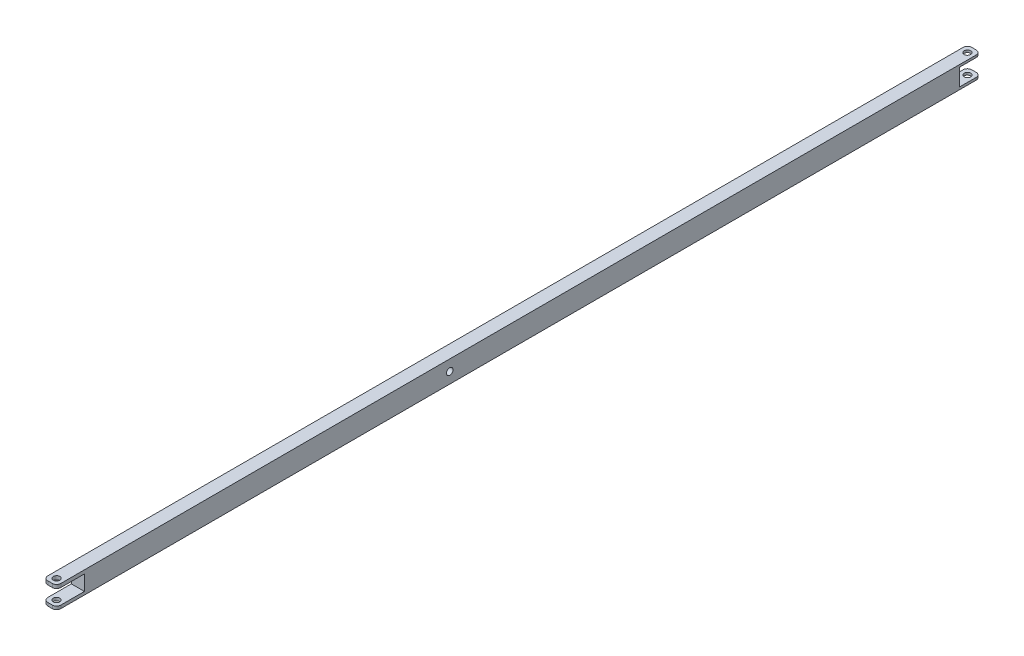
ISO-10303-21;
HEADER;
FILE_DESCRIPTION(('STEP AP214'),'2;1');
FILE_NAME('part.step','',(''),(''),'','','');
FILE_SCHEMA(('AUTOMOTIVE_DESIGN { 1 0 10303 214 1 1 1 1 }'));
ENDSEC;
DATA;
#1=APPLICATION_CONTEXT('core data for automotive mechanical design processes');
#2=APPLICATION_PROTOCOL_DEFINITION('international standard','automotive_design',2000,#1);
#3=PRODUCT_CONTEXT('',#1,'mechanical');
#4=PRODUCT('Part','Part','',(#3));
#5=PRODUCT_RELATED_PRODUCT_CATEGORY('part','',(#4));
#6=PRODUCT_DEFINITION_FORMATION('','',#4);
#7=PRODUCT_DEFINITION_CONTEXT('part definition',#1,'design');
#8=PRODUCT_DEFINITION('design','',#6,#7);
#9=PRODUCT_DEFINITION_SHAPE('','',#8);
#10=(LENGTH_UNIT() NAMED_UNIT(*) SI_UNIT(.MILLI.,.METRE.));
#11=(NAMED_UNIT(*) PLANE_ANGLE_UNIT() SI_UNIT($,.RADIAN.));
#12=(NAMED_UNIT(*) SI_UNIT($,.STERADIAN.) SOLID_ANGLE_UNIT());
#13=UNCERTAINTY_MEASURE_WITH_UNIT(LENGTH_MEASURE(1.E-05),#10,'distance_accuracy_value','');
#14=(GEOMETRIC_REPRESENTATION_CONTEXT(3) GLOBAL_UNCERTAINTY_ASSIGNED_CONTEXT((#13)) GLOBAL_UNIT_ASSIGNED_CONTEXT((#10,
#11,#12)) REPRESENTATION_CONTEXT('',''));
#15=CARTESIAN_POINT('',(0.,0.,0.));
#16=DIRECTION('',(0.,0.,1.));
#17=DIRECTION('',(1.,0.,0.));
#18=AXIS2_PLACEMENT_3D('',#15,#16,#17);
#19=CARTESIAN_POINT('',(0.,0.,-80.));
#20=DIRECTION('',(0.,0.,-1.));
#21=DIRECTION('',(-1.,0.,0.));
#22=AXIS2_PLACEMENT_3D('',#19,#20,#21);
#23=PLANE('',#22);
#24=DIRECTION('',(-1.,0.,0.));
#25=VECTOR('',#24,1.);
#26=CARTESIAN_POINT('',(0.,1.42668803014151,-80.));
#27=LINE('',#26,#25);
#28=CARTESIAN_POINT('',(5.12,1.42668803014152,-80.));
#29=VERTEX_POINT('',#28);
#30=CARTESIAN_POINT('',(2.5,1.42668803014151,-80.));
#31=VERTEX_POINT('',#30);
#32=EDGE_CURVE('E316',#29,#31,#27,.T.);
#33=ORIENTED_EDGE('',*,*,#32,.F.);
#34=DIRECTION('',(0.,-1.,0.));
#35=VECTOR('',#34,1.);
#36=CARTESIAN_POINT('',(5.12,0.,-80.));
#37=LINE('',#36,#35);
#38=CARTESIAN_POINT('',(5.12,0.,-80.));
#39=VERTEX_POINT('',#38);
#40=EDGE_CURVE('E348',#29,#39,#37,.T.);
#41=ORIENTED_EDGE('',*,*,#40,.T.);
#42=DIRECTION('',(-1.,0.,0.));
#43=VECTOR('',#42,1.);
#44=CARTESIAN_POINT('',(7.62,0.,-80.));
#45=LINE('',#44,#43);
#46=CARTESIAN_POINT('',(2.5,0.,-80.));
#47=VERTEX_POINT('',#46);
#48=EDGE_CURVE('E211',#39,#47,#45,.T.);
#49=ORIENTED_EDGE('',*,*,#48,.T.);
#50=DIRECTION('',(0.,1.,0.));
#51=VECTOR('',#50,1.);
#52=CARTESIAN_POINT('',(2.5,1.42668803014151,-80.));
#53=LINE('',#52,#51);
#54=EDGE_CURVE('E345',#47,#31,#53,.T.);
#55=ORIENTED_EDGE('',*,*,#54,.T.);
#56=EDGE_LOOP('',(#33,#41,#49,#55));
#57=FACE_BOUND('',#56,.T.);
#58=ADVANCED_FACE('F35',(#57),#23,.T.);
#59=CARTESIAN_POINT('',(0.,0.,457.2));
#60=DIRECTION('',(0.,0.,-1.));
#61=DIRECTION('',(-1.,0.,0.));
#62=AXIS2_PLACEMENT_3D('',#59,#60,#61);
#63=PLANE('',#62);
#64=DIRECTION('',(1.,0.,0.));
#65=VECTOR('',#64,1.);
#66=CARTESIAN_POINT('',(0.,10.6364679224859,457.2));
#67=LINE('',#66,#65);
#68=CARTESIAN_POINT('',(2.5,10.6364679224859,457.2));
#69=VERTEX_POINT('',#68);
#70=CARTESIAN_POINT('',(5.12,10.6364679224859,457.2));
#71=VERTEX_POINT('',#70);
#72=EDGE_CURVE('E273',#69,#71,#67,.T.);
#73=ORIENTED_EDGE('',*,*,#72,.T.);
#74=DIRECTION('',(0.,1.,0.));
#75=VECTOR('',#74,1.);
#76=CARTESIAN_POINT('',(5.12,0.,457.2));
#77=LINE('',#76,#75);
#78=CARTESIAN_POINT('',(5.11999999999999,12.7,457.2));
#79=VERTEX_POINT('',#78);
#80=EDGE_CURVE('E303',#71,#79,#77,.T.);
#81=ORIENTED_EDGE('',*,*,#80,.T.);
#82=DIRECTION('',(-1.,0.,0.));
#83=VECTOR('',#82,1.);
#84=CARTESIAN_POINT('',(0.,12.7,457.2));
#85=LINE('',#84,#83);
#86=CARTESIAN_POINT('',(2.5,12.7,457.2));
#87=VERTEX_POINT('',#86);
#88=EDGE_CURVE('E256',#79,#87,#85,.T.);
#89=ORIENTED_EDGE('',*,*,#88,.T.);
#90=DIRECTION('',(0.,-1.,0.));
#91=VECTOR('',#90,1.);
#92=CARTESIAN_POINT('',(2.5,0.,457.2));
#93=LINE('',#92,#91);
#94=EDGE_CURVE('E300',#87,#69,#93,.T.);
#95=ORIENTED_EDGE('',*,*,#94,.T.);
#96=EDGE_LOOP('',(#73,#81,#89,#95));
#97=FACE_BOUND('',#96,.T.);
#98=ADVANCED_FACE('F378',(#97),#63,.F.);
#99=CARTESIAN_POINT('',(0.,0.,457.2));
#100=DIRECTION('',(1.,0.,0.));
#101=DIRECTION('',(0.,1.,0.));
#102=AXIS2_PLACEMENT_3D('',#99,#100,#101);
#103=PLANE('',#102);
#104=CARTESIAN_POINT('',(0.,6.35,228.6));
#105=DIRECTION('',(1.,0.,0.));
#106=DIRECTION('',(0.,1.,0.));
#107=AXIS2_PLACEMENT_3D('',#104,#105,#106);
#108=CIRCLE('',#107,1.90499999999999);
#109=CARTESIAN_POINT('',(0.,8.25499999999999,228.6));
#110=VERTEX_POINT('',#109);
#111=EDGE_CURVE('E250',#110,#110,#108,.T.);
#112=ORIENTED_EDGE('',*,*,#111,.T.);
#113=EDGE_LOOP('',(#112));
#114=FACE_BOUND('',#113,.T.);
#115=DIRECTION('',(0.,0.,-1.));
#116=VECTOR('',#115,1.);
#117=CARTESIAN_POINT('',(0.,12.7,457.2));
#118=LINE('',#117,#116);
#119=CARTESIAN_POINT('',(0.,12.7,454.7));
#120=VERTEX_POINT('',#119);
#121=CARTESIAN_POINT('',(0.,12.7,-77.5));
#122=VERTEX_POINT('',#121);
#123=EDGE_CURVE('E259',#120,#122,#118,.T.);
#124=ORIENTED_EDGE('',*,*,#123,.T.);
#125=DIRECTION('',(0.,1.,0.));
#126=VECTOR('',#125,1.);
#127=CARTESIAN_POINT('',(0.,11.3648777422697,-77.5));
#128=LINE('',#127,#126);
#129=CARTESIAN_POINT('',(0.,11.3648777422697,-77.5));
#130=VERTEX_POINT('',#129);
#131=EDGE_CURVE('E336',#122,#130,#128,.F.);
#132=ORIENTED_EDGE('',*,*,#131,.T.);
#133=DIRECTION('',(0.,0.,1.));
#134=VECTOR('',#133,1.);
#135=CARTESIAN_POINT('',(0.,11.3648777422697,457.2));
#136=LINE('',#135,#134);
#137=CARTESIAN_POINT('',(0.,11.3648777422697,-67.8669017495956));
#138=VERTEX_POINT('',#137);
#139=EDGE_CURVE('E204',#130,#138,#136,.T.);
#140=ORIENTED_EDGE('',*,*,#139,.T.);
#141=DIRECTION('',(0.,-1.,0.));
#142=VECTOR('',#141,1.);
#143=CARTESIAN_POINT('',(0.,0.,-67.8669017495957));
#144=LINE('',#143,#142);
#145=CARTESIAN_POINT('',(0.,1.42668803014151,-67.8669017495956));
#146=VERTEX_POINT('',#145);
#147=EDGE_CURVE('E194',#138,#146,#144,.T.);
#148=ORIENTED_EDGE('',*,*,#147,.T.);
#149=DIRECTION('',(0.,0.,-1.));
#150=VECTOR('',#149,1.);
#151=CARTESIAN_POINT('',(0.,1.42668803014151,457.2));
#152=LINE('',#151,#150);
#153=CARTESIAN_POINT('',(0.,1.42668803014151,-77.5));
#154=VERTEX_POINT('',#153);
#155=EDGE_CURVE('E207',#146,#154,#152,.T.);
#156=ORIENTED_EDGE('',*,*,#155,.T.);
#157=DIRECTION('',(0.,1.,0.));
#158=VECTOR('',#157,1.);
#159=CARTESIAN_POINT('',(0.,0.,-77.5));
#160=LINE('',#159,#158);
#161=CARTESIAN_POINT('',(0.,0.,-77.5));
#162=VERTEX_POINT('',#161);
#163=EDGE_CURVE('E334',#154,#162,#160,.F.);
#164=ORIENTED_EDGE('',*,*,#163,.T.);
#165=DIRECTION('',(0.,0.,-1.));
#166=VECTOR('',#165,1.);
#167=CARTESIAN_POINT('',(0.,0.,457.2));
#168=LINE('',#167,#166);
#169=CARTESIAN_POINT('',(0.,0.,454.7));
#170=VERTEX_POINT('',#169);
#171=EDGE_CURVE('E268',#170,#162,#168,.T.);
#172=ORIENTED_EDGE('',*,*,#171,.F.);
#173=DIRECTION('',(0.,-1.,0.));
#174=VECTOR('',#173,1.);
#175=CARTESIAN_POINT('',(0.,0.,454.7));
#176=LINE('',#175,#174);
#177=CARTESIAN_POINT('',(0.,1.81598845239703,454.7));
#178=VERTEX_POINT('',#177);
#179=EDGE_CURVE('E290',#170,#178,#176,.F.);
#180=ORIENTED_EDGE('',*,*,#179,.T.);
#181=DIRECTION('',(0.,0.,-1.));
#182=VECTOR('',#181,1.);
#183=CARTESIAN_POINT('',(0.,1.81598845239703,457.2));
#184=LINE('',#183,#182);
#185=CARTESIAN_POINT('',(0.,1.81598845239703,441.01304137713));
#186=VERTEX_POINT('',#185);
#187=EDGE_CURVE('E237',#178,#186,#184,.T.);
#188=ORIENTED_EDGE('',*,*,#187,.T.);
#189=DIRECTION('',(0.,1.,0.));
#190=VECTOR('',#189,1.);
#191=CARTESIAN_POINT('',(0.,0.,441.01304137713));
#192=LINE('',#191,#190);
#193=CARTESIAN_POINT('',(0.,10.6364679224859,441.01304137713));
#194=VERTEX_POINT('',#193);
#195=EDGE_CURVE('E244',#186,#194,#192,.T.);
#196=ORIENTED_EDGE('',*,*,#195,.T.);
#197=DIRECTION('',(0.,0.,1.));
#198=VECTOR('',#197,1.);
#199=CARTESIAN_POINT('',(0.,10.6364679224859,457.2));
#200=LINE('',#199,#198);
#201=CARTESIAN_POINT('',(0.,10.6364679224859,454.7));
#202=VERTEX_POINT('',#201);
#203=EDGE_CURVE('E241',#194,#202,#200,.T.);
#204=ORIENTED_EDGE('',*,*,#203,.T.);
#205=DIRECTION('',(0.,-1.,0.));
#206=VECTOR('',#205,1.);
#207=CARTESIAN_POINT('',(0.,0.,454.7));
#208=LINE('',#207,#206);
#209=EDGE_CURVE('E288',#202,#120,#208,.F.);
#210=ORIENTED_EDGE('',*,*,#209,.T.);
#211=EDGE_LOOP('',(#124,#132,#140,#148,#156,#164,#172,#180,#188,#196,#204,#210));
#212=FACE_BOUND('',#211,.T.);
#213=ADVANCED_FACE('F358',(#114,#212),#103,.F.);
#214=CARTESIAN_POINT('',(0.,0.,457.2));
#215=DIRECTION('',(0.,1.,0.));
#216=DIRECTION('',(0.,0.,1.));
#217=AXIS2_PLACEMENT_3D('',#214,#215,#216);
#218=PLANE('',#217);
#219=CARTESIAN_POINT('',(3.89156117547884,0.,-76.1084388245213));
#220=DIRECTION('',(0.,1.,0.));
#221=DIRECTION('',(0.,0.,1.));
#222=AXIS2_PLACEMENT_3D('',#219,#220,#221);
#223=CIRCLE('',#222,1.90500000000001);
#224=CARTESIAN_POINT('',(3.89156117547884,0.,-74.2034388245212));
#225=VERTEX_POINT('',#224);
#226=EDGE_CURVE('E185',#225,#225,#223,.T.);
#227=ORIENTED_EDGE('',*,*,#226,.T.);
#228=EDGE_LOOP('',(#227));
#229=FACE_BOUND('',#228,.T.);
#230=CARTESIAN_POINT('',(3.81,0.,453.39));
#231=DIRECTION('',(0.,1.,0.));
#232=DIRECTION('',(0.,0.,1.));
#233=AXIS2_PLACEMENT_3D('',#230,#231,#232);
#234=CIRCLE('',#233,1.90585659935235);
#235=CARTESIAN_POINT('',(3.81,0.,455.295856599352));
#236=VERTEX_POINT('',#235);
#237=EDGE_CURVE('E223',#236,#236,#234,.T.);
#238=ORIENTED_EDGE('',*,*,#237,.T.);
#239=EDGE_LOOP('',(#238));
#240=FACE_BOUND('',#239,.T.);
#241=ORIENTED_EDGE('',*,*,#48,.F.);
#242=CARTESIAN_POINT('',(5.12,0.,-77.5));
#243=DIRECTION('',(0.,1.,0.));
#244=DIRECTION('',(0.,0.,1.));
#245=AXIS2_PLACEMENT_3D('',#242,#243,#244);
#246=CIRCLE('',#245,2.5);
#247=CARTESIAN_POINT('',(7.62,0.,-77.5));
#248=VERTEX_POINT('',#247);
#249=EDGE_CURVE('E58',#39,#248,#246,.F.);
#250=ORIENTED_EDGE('',*,*,#249,.T.);
#251=DIRECTION('',(0.,0.,-1.));
#252=VECTOR('',#251,1.);
#253=CARTESIAN_POINT('',(7.62,0.,457.2));
#254=LINE('',#253,#252);
#255=CARTESIAN_POINT('',(7.62,0.,454.7));
#256=VERTEX_POINT('',#255);
#257=EDGE_CURVE('E265',#256,#248,#254,.T.);
#258=ORIENTED_EDGE('',*,*,#257,.F.);
#259=CARTESIAN_POINT('',(5.12,0.,454.7));
#260=DIRECTION('',(0.,1.,0.));
#261=DIRECTION('',(0.,0.,1.));
#262=AXIS2_PLACEMENT_3D('',#259,#260,#261);
#263=CIRCLE('',#262,2.5);
#264=CARTESIAN_POINT('',(5.12,0.,457.2));
#265=VERTEX_POINT('',#264);
#266=EDGE_CURVE('E284',#256,#265,#263,.F.);
#267=ORIENTED_EDGE('',*,*,#266,.T.);
#268=DIRECTION('',(1.,0.,0.));
#269=VECTOR('',#268,1.);
#270=CARTESIAN_POINT('',(0.,0.,457.2));
#271=LINE('',#270,#269);
#272=CARTESIAN_POINT('',(2.5,0.,457.2));
#273=VERTEX_POINT('',#272);
#274=EDGE_CURVE('E253',#273,#265,#271,.T.);
#275=ORIENTED_EDGE('',*,*,#274,.F.);
#276=CARTESIAN_POINT('',(2.5,0.,454.7));
#277=DIRECTION('',(0.,1.,0.));
#278=DIRECTION('',(0.,0.,1.));
#279=AXIS2_PLACEMENT_3D('',#276,#277,#278);
#280=CIRCLE('',#279,2.5);
#281=EDGE_CURVE('E286',#273,#170,#280,.F.);
#282=ORIENTED_EDGE('',*,*,#281,.T.);
#283=ORIENTED_EDGE('',*,*,#171,.T.);
#284=CARTESIAN_POINT('',(2.5,0.,-77.5));
#285=DIRECTION('',(0.,1.,0.));
#286=DIRECTION('',(0.,0.,1.));
#287=AXIS2_PLACEMENT_3D('',#284,#285,#286);
#288=CIRCLE('',#287,2.5);
#289=EDGE_CURVE('E50',#162,#47,#288,.F.);
#290=ORIENTED_EDGE('',*,*,#289,.T.);
#291=EDGE_LOOP('',(#241,#250,#258,#267,#275,#282,#283,#290));
#292=FACE_BOUND('',#291,.T.);
#293=ADVANCED_FACE('F361',(#229,#240,#292),#218,.F.);
#294=CARTESIAN_POINT('',(7.62,0.,457.2));
#295=DIRECTION('',(-1.,0.,0.));
#296=DIRECTION('',(0.,-1.,0.));
#297=AXIS2_PLACEMENT_3D('',#294,#295,#296);
#298=PLANE('',#297);
#299=CARTESIAN_POINT('',(7.62,6.35,228.6));
#300=DIRECTION('',(1.,0.,0.));
#301=DIRECTION('',(0.,1.,0.));
#302=AXIS2_PLACEMENT_3D('',#299,#300,#301);
#303=CIRCLE('',#302,1.90499999999999);
#304=CARTESIAN_POINT('',(7.62,8.25499999999999,228.6));
#305=VERTEX_POINT('',#304);
#306=EDGE_CURVE('E247',#305,#305,#303,.T.);
#307=ORIENTED_EDGE('',*,*,#306,.F.);
#308=EDGE_LOOP('',(#307));
#309=FACE_BOUND('',#308,.T.);
#310=DIRECTION('',(0.,0.,1.));
#311=VECTOR('',#310,1.);
#312=CARTESIAN_POINT('',(7.62,11.3648777422697,-80.));
#313=LINE('',#312,#311);
#314=CARTESIAN_POINT('',(7.62,11.3648777422697,-77.5));
#315=VERTEX_POINT('',#314);
#316=CARTESIAN_POINT('',(7.62,11.3648777422697,-67.8669017495956));
#317=VERTEX_POINT('',#316);
#318=EDGE_CURVE('E174',#315,#317,#313,.T.);
#319=ORIENTED_EDGE('',*,*,#318,.F.);
#320=DIRECTION('',(0.,-1.,0.));
#321=VECTOR('',#320,1.);
#322=CARTESIAN_POINT('',(7.62,12.7,-77.5));
#323=LINE('',#322,#321);
#324=CARTESIAN_POINT('',(7.62,12.7,-77.5));
#325=VERTEX_POINT('',#324);
#326=EDGE_CURVE('E343',#315,#325,#323,.F.);
#327=ORIENTED_EDGE('',*,*,#326,.T.);
#328=DIRECTION('',(0.,0.,-1.));
#329=VECTOR('',#328,1.);
#330=CARTESIAN_POINT('',(7.62,12.7,457.2));
#331=LINE('',#330,#329);
#332=CARTESIAN_POINT('',(7.62,12.7,454.7));
#333=VERTEX_POINT('',#332);
#334=EDGE_CURVE('E262',#333,#325,#331,.T.);
#335=ORIENTED_EDGE('',*,*,#334,.F.);
#336=DIRECTION('',(0.,1.,0.));
#337=VECTOR('',#336,1.);
#338=CARTESIAN_POINT('',(7.62,0.,454.7));
#339=LINE('',#338,#337);
#340=CARTESIAN_POINT('',(7.62,10.6364679224859,454.7));
#341=VERTEX_POINT('',#340);
#342=EDGE_CURVE('E296',#333,#341,#339,.F.);
#343=ORIENTED_EDGE('',*,*,#342,.T.);
#344=DIRECTION('',(0.,0.,1.));
#345=VECTOR('',#344,1.);
#346=CARTESIAN_POINT('',(7.62,10.6364679224859,457.2));
#347=LINE('',#346,#345);
#348=CARTESIAN_POINT('',(7.62,10.6364679224859,441.01304137713));
#349=VERTEX_POINT('',#348);
#350=EDGE_CURVE('E231',#349,#341,#347,.T.);
#351=ORIENTED_EDGE('',*,*,#350,.F.);
#352=DIRECTION('',(0.,1.,0.));
#353=VECTOR('',#352,1.);
#354=CARTESIAN_POINT('',(7.62,10.6364679224859,441.01304137713));
#355=LINE('',#354,#353);
#356=CARTESIAN_POINT('',(7.62,1.81598845239703,441.01304137713));
#357=VERTEX_POINT('',#356);
#358=EDGE_CURVE('E228',#357,#349,#355,.T.);
#359=ORIENTED_EDGE('',*,*,#358,.F.);
#360=DIRECTION('',(0.,0.,-1.));
#361=VECTOR('',#360,1.);
#362=CARTESIAN_POINT('',(7.62,1.81598845239703,457.2));
#363=LINE('',#362,#361);
#364=CARTESIAN_POINT('',(7.62,1.81598845239703,454.7));
#365=VERTEX_POINT('',#364);
#366=EDGE_CURVE('E226',#365,#357,#363,.T.);
#367=ORIENTED_EDGE('',*,*,#366,.F.);
#368=DIRECTION('',(0.,1.,0.));
#369=VECTOR('',#368,1.);
#370=CARTESIAN_POINT('',(7.62,0.,454.7));
#371=LINE('',#370,#369);
#372=EDGE_CURVE('E298',#365,#256,#371,.F.);
#373=ORIENTED_EDGE('',*,*,#372,.T.);
#374=ORIENTED_EDGE('',*,*,#257,.T.);
#375=DIRECTION('',(0.,-1.,0.));
#376=VECTOR('',#375,1.);
#377=CARTESIAN_POINT('',(7.62,1.42668803014152,-77.5));
#378=LINE('',#377,#376);
#379=CARTESIAN_POINT('',(7.62,1.42668803014152,-77.5));
#380=VERTEX_POINT('',#379);
#381=EDGE_CURVE('E341',#248,#380,#378,.F.);
#382=ORIENTED_EDGE('',*,*,#381,.T.);
#383=DIRECTION('',(0.,0.,-1.));
#384=VECTOR('',#383,1.);
#385=CARTESIAN_POINT('',(7.62,1.42668803014152,-80.));
#386=LINE('',#385,#384);
#387=CARTESIAN_POINT('',(7.62,1.42668803014152,-67.8669017495956));
#388=VERTEX_POINT('',#387);
#389=EDGE_CURVE('E196',#388,#380,#386,.T.);
#390=ORIENTED_EDGE('',*,*,#389,.F.);
#391=DIRECTION('',(0.,-1.,0.));
#392=VECTOR('',#391,1.);
#393=CARTESIAN_POINT('',(7.62,11.3648777422697,-67.8669017495956));
#394=LINE('',#393,#392);
#395=EDGE_CURVE('E184',#317,#388,#394,.T.);
#396=ORIENTED_EDGE('',*,*,#395,.F.);
#397=EDGE_LOOP('',(#319,#327,#335,#343,#351,#359,#367,#373,#374,#382,#390,#396));
#398=FACE_BOUND('',#397,.T.);
#399=ADVANCED_FACE('F198',(#309,#398),#298,.F.);
#400=CARTESIAN_POINT('',(0.,12.7,457.2));
#401=DIRECTION('',(0.,-1.,0.));
#402=DIRECTION('',(0.,0.,-1.));
#403=AXIS2_PLACEMENT_3D('',#400,#401,#402);
#404=PLANE('',#403);
#405=CARTESIAN_POINT('',(3.89156117547884,12.7,-76.1084388245213));
#406=DIRECTION('',(0.,1.,0.));
#407=DIRECTION('',(0.,0.,1.));
#408=AXIS2_PLACEMENT_3D('',#405,#406,#407);
#409=CIRCLE('',#408,1.90500000000001);
#410=CARTESIAN_POINT('',(3.89156117547884,12.7,-74.2034388245212));
#411=VERTEX_POINT('',#410);
#412=EDGE_CURVE('E324',#411,#411,#409,.T.);
#413=ORIENTED_EDGE('',*,*,#412,.F.);
#414=EDGE_LOOP('',(#413));
#415=FACE_BOUND('',#414,.T.);
#416=CARTESIAN_POINT('',(3.81,12.7,453.39));
#417=DIRECTION('',(0.,1.,0.));
#418=DIRECTION('',(0.,0.,1.));
#419=AXIS2_PLACEMENT_3D('',#416,#417,#418);
#420=CIRCLE('',#419,1.90585659935235);
#421=CARTESIAN_POINT('',(3.81,12.7,455.295856599352));
#422=VERTEX_POINT('',#421);
#423=EDGE_CURVE('E216',#422,#422,#420,.T.);
#424=ORIENTED_EDGE('',*,*,#423,.F.);
#425=EDGE_LOOP('',(#424));
#426=FACE_BOUND('',#425,.T.);
#427=DIRECTION('',(1.,0.,0.));
#428=VECTOR('',#427,1.);
#429=CARTESIAN_POINT('',(0.,12.7,-80.));
#430=LINE('',#429,#428);
#431=CARTESIAN_POINT('',(2.5,12.7,-80.));
#432=VERTEX_POINT('',#431);
#433=CARTESIAN_POINT('',(5.11999999999999,12.7,-80.));
#434=VERTEX_POINT('',#433);
#435=EDGE_CURVE('E213',#432,#434,#430,.T.);
#436=ORIENTED_EDGE('',*,*,#435,.F.);
#437=CARTESIAN_POINT('',(2.5,12.7,-77.5));
#438=DIRECTION('',(0.,-1.,0.));
#439=DIRECTION('',(0.,0.,-1.));
#440=AXIS2_PLACEMENT_3D('',#437,#438,#439);
#441=CIRCLE('',#440,2.5);
#442=EDGE_CURVE('E332',#432,#122,#441,.F.);
#443=ORIENTED_EDGE('',*,*,#442,.T.);
#444=ORIENTED_EDGE('',*,*,#123,.F.);
#445=CARTESIAN_POINT('',(2.5,12.7,454.7));
#446=DIRECTION('',(0.,-1.,0.));
#447=DIRECTION('',(0.,0.,-1.));
#448=AXIS2_PLACEMENT_3D('',#445,#446,#447);
#449=CIRCLE('',#448,2.5);
#450=EDGE_CURVE('E306',#120,#87,#449,.F.);
#451=ORIENTED_EDGE('',*,*,#450,.T.);
#452=ORIENTED_EDGE('',*,*,#88,.F.);
#453=CARTESIAN_POINT('',(5.12,12.7,454.7));
#454=DIRECTION('',(0.,-1.,0.));
#455=DIRECTION('',(0.,0.,-1.));
#456=AXIS2_PLACEMENT_3D('',#453,#454,#455);
#457=CIRCLE('',#456,2.5);
#458=EDGE_CURVE('E308',#79,#333,#457,.F.);
#459=ORIENTED_EDGE('',*,*,#458,.T.);
#460=ORIENTED_EDGE('',*,*,#334,.T.);
#461=CARTESIAN_POINT('',(5.12,12.7,-77.5));
#462=DIRECTION('',(0.,-1.,0.));
#463=DIRECTION('',(0.,0.,-1.));
#464=AXIS2_PLACEMENT_3D('',#461,#462,#463);
#465=CIRCLE('',#464,2.5);
#466=EDGE_CURVE('E330',#325,#434,#465,.F.);
#467=ORIENTED_EDGE('',*,*,#466,.T.);
#468=EDGE_LOOP('',(#436,#443,#444,#451,#452,#459,#460,#467));
#469=FACE_BOUND('',#468,.T.);
#470=ADVANCED_FACE('F409',(#415,#426,#469),#404,.F.);
#471=DIRECTION('',(-1.,0.,0.));
#472=VECTOR('',#471,1.);
#473=CARTESIAN_POINT('',(0.,1.81598845239703,457.2));
#474=LINE('',#473,#472);
#475=CARTESIAN_POINT('',(5.12,1.81598845239703,457.2));
#476=VERTEX_POINT('',#475);
#477=CARTESIAN_POINT('',(2.5,1.81598845239703,457.2));
#478=VERTEX_POINT('',#477);
#479=EDGE_CURVE('E270',#476,#478,#474,.T.);
#480=ORIENTED_EDGE('',*,*,#479,.T.);
#481=DIRECTION('',(0.,-1.,0.));
#482=VECTOR('',#481,1.);
#483=CARTESIAN_POINT('',(2.5,0.,457.2));
#484=LINE('',#483,#482);
#485=EDGE_CURVE('E281',#478,#273,#484,.T.);
#486=ORIENTED_EDGE('',*,*,#485,.T.);
#487=ORIENTED_EDGE('',*,*,#274,.T.);
#488=DIRECTION('',(0.,1.,0.));
#489=VECTOR('',#488,1.);
#490=CARTESIAN_POINT('',(5.12,0.,457.2));
#491=LINE('',#490,#489);
#492=EDGE_CURVE('E276',#265,#476,#491,.T.);
#493=ORIENTED_EDGE('',*,*,#492,.T.);
#494=EDGE_LOOP('',(#480,#486,#487,#493));
#495=FACE_BOUND('',#494,.T.);
#496=ADVANCED_FACE('F386',(#495),#63,.F.);
#497=CARTESIAN_POINT('',(-7.38,6.35,228.6));
#498=DIRECTION('',(1.,0.,0.));
#499=DIRECTION('',(0.,1.,0.));
#500=AXIS2_PLACEMENT_3D('',#497,#498,#499);
#501=CYLINDRICAL_SURFACE('',#500,1.90499999999999);
#502=ORIENTED_EDGE('',*,*,#306,.T.);
#503=EDGE_LOOP('',(#502));
#504=FACE_BOUND('',#503,.T.);
#505=ORIENTED_EDGE('',*,*,#111,.F.);
#506=EDGE_LOOP('',(#505));
#507=FACE_BOUND('',#506,.T.);
#508=ADVANCED_FACE('F458',(#504,#507),#501,.F.);
#509=CARTESIAN_POINT('',(-7.38,10.6364679224859,441.01304137713));
#510=DIRECTION('',(0.,0.,-1.));
#511=DIRECTION('',(-1.,0.,0.));
#512=AXIS2_PLACEMENT_3D('',#509,#510,#511);
#513=PLANE('',#512);
#514=DIRECTION('',(1.,0.,0.));
#515=VECTOR('',#514,1.);
#516=CARTESIAN_POINT('',(-7.38,1.81598845239702,441.01304137713));
#517=LINE('',#516,#515);
#518=EDGE_CURVE('E234',#186,#357,#517,.T.);
#519=ORIENTED_EDGE('',*,*,#518,.T.);
#520=ORIENTED_EDGE('',*,*,#358,.T.);
#521=DIRECTION('',(1.,0.,0.));
#522=VECTOR('',#521,1.);
#523=CARTESIAN_POINT('',(-7.38,10.6364679224859,441.01304137713));
#524=LINE('',#523,#522);
#525=EDGE_CURVE('E235',#194,#349,#524,.T.);
#526=ORIENTED_EDGE('',*,*,#525,.F.);
#527=ORIENTED_EDGE('',*,*,#195,.F.);
#528=EDGE_LOOP('',(#519,#520,#526,#527));
#529=FACE_BOUND('',#528,.T.);
#530=ADVANCED_FACE('F428',(#529),#513,.F.);
#531=CARTESIAN_POINT('',(-7.38,10.6364679224859,457.2));
#532=DIRECTION('',(0.,1.,0.));
#533=DIRECTION('',(-1.,0.,0.));
#534=AXIS2_PLACEMENT_3D('',#531,#532,#533);
#535=PLANE('',#534);
#536=CARTESIAN_POINT('',(3.81,10.6364679224859,453.39));
#537=DIRECTION('',(0.,1.,0.));
#538=DIRECTION('',(-1.,0.,0.));
#539=AXIS2_PLACEMENT_3D('',#536,#537,#538);
#540=CIRCLE('',#539,1.90585659935235);
#541=CARTESIAN_POINT('',(1.90414340064765,10.6364679224859,453.39));
#542=VERTEX_POINT('',#541);
#543=EDGE_CURVE('E220',#542,#542,#540,.T.);
#544=ORIENTED_EDGE('',*,*,#543,.T.);
#545=EDGE_LOOP('',(#544));
#546=FACE_BOUND('',#545,.T.);
#547=ORIENTED_EDGE('',*,*,#350,.T.);
#548=CARTESIAN_POINT('',(5.12,10.6364679224859,454.7));
#549=DIRECTION('',(0.,1.,0.));
#550=DIRECTION('',(-1.,0.,0.));
#551=AXIS2_PLACEMENT_3D('',#548,#549,#550);
#552=CIRCLE('',#551,2.5);
#553=EDGE_CURVE('E312',#341,#71,#552,.F.);
#554=ORIENTED_EDGE('',*,*,#553,.T.);
#555=ORIENTED_EDGE('',*,*,#72,.F.);
#556=CARTESIAN_POINT('',(2.5,10.6364679224859,454.7));
#557=DIRECTION('',(0.,1.,0.));
#558=DIRECTION('',(-1.,0.,0.));
#559=AXIS2_PLACEMENT_3D('',#556,#557,#558);
#560=CIRCLE('',#559,2.5);
#561=EDGE_CURVE('E310',#69,#202,#560,.F.);
#562=ORIENTED_EDGE('',*,*,#561,.T.);
#563=ORIENTED_EDGE('',*,*,#203,.F.);
#564=ORIENTED_EDGE('',*,*,#525,.T.);
#565=EDGE_LOOP('',(#547,#554,#555,#562,#563,#564));
#566=FACE_BOUND('',#565,.T.);
#567=ADVANCED_FACE('F424',(#546,#566),#535,.F.);
#568=CARTESIAN_POINT('',(-7.38,1.81598845239702,457.2));
#569=DIRECTION('',(0.,-1.,0.));
#570=DIRECTION('',(1.,0.,0.));
#571=AXIS2_PLACEMENT_3D('',#568,#569,#570);
#572=PLANE('',#571);
#573=CARTESIAN_POINT('',(3.81,1.81598845239703,453.39));
#574=DIRECTION('',(0.,-1.,0.));
#575=DIRECTION('',(1.,0.,0.));
#576=AXIS2_PLACEMENT_3D('',#573,#574,#575);
#577=CIRCLE('',#576,1.90585659935235);
#578=CARTESIAN_POINT('',(5.71585659935235,1.81598845239703,453.39));
#579=VERTEX_POINT('',#578);
#580=EDGE_CURVE('E219',#579,#579,#577,.T.);
#581=ORIENTED_EDGE('',*,*,#580,.T.);
#582=EDGE_LOOP('',(#581));
#583=FACE_BOUND('',#582,.T.);
#584=ORIENTED_EDGE('',*,*,#187,.F.);
#585=CARTESIAN_POINT('',(2.5,1.81598845239703,454.7));
#586=DIRECTION('',(0.,-1.,0.));
#587=DIRECTION('',(1.,0.,0.));
#588=AXIS2_PLACEMENT_3D('',#585,#586,#587);
#589=CIRCLE('',#588,2.5);
#590=EDGE_CURVE('E294',#178,#478,#589,.F.);
#591=ORIENTED_EDGE('',*,*,#590,.T.);
#592=ORIENTED_EDGE('',*,*,#479,.F.);
#593=CARTESIAN_POINT('',(5.12,1.81598845239703,454.7));
#594=DIRECTION('',(0.,-1.,0.));
#595=DIRECTION('',(1.,0.,0.));
#596=AXIS2_PLACEMENT_3D('',#593,#594,#595);
#597=CIRCLE('',#596,2.5);
#598=EDGE_CURVE('E292',#476,#365,#597,.F.);
#599=ORIENTED_EDGE('',*,*,#598,.T.);
#600=ORIENTED_EDGE('',*,*,#366,.T.);
#601=ORIENTED_EDGE('',*,*,#518,.F.);
#602=EDGE_LOOP('',(#584,#591,#592,#599,#600,#601));
#603=FACE_BOUND('',#602,.T.);
#604=ADVANCED_FACE('F443',(#583,#603),#572,.F.);
#605=CARTESIAN_POINT('',(3.81,-2.3,453.39));
#606=DIRECTION('',(0.,1.,0.));
#607=DIRECTION('',(0.,0.,1.));
#608=AXIS2_PLACEMENT_3D('',#605,#606,#607);
#609=CYLINDRICAL_SURFACE('',#608,1.90585659935235);
#610=ORIENTED_EDGE('',*,*,#580,.F.);
#611=EDGE_LOOP('',(#610));
#612=FACE_BOUND('',#611,.T.);
#613=ORIENTED_EDGE('',*,*,#237,.F.);
#614=EDGE_LOOP('',(#613));
#615=FACE_BOUND('',#614,.T.);
#616=ADVANCED_FACE('F445',(#612,#615),#609,.F.);
#617=ORIENTED_EDGE('',*,*,#423,.T.);
#618=EDGE_LOOP('',(#617));
#619=FACE_BOUND('',#618,.T.);
#620=ORIENTED_EDGE('',*,*,#543,.F.);
#621=EDGE_LOOP('',(#620));
#622=FACE_BOUND('',#621,.T.);
#623=ADVANCED_FACE('F452',(#619,#622),#609,.F.);
#624=CARTESIAN_POINT('',(2.5,0.,454.7));
#625=DIRECTION('',(0.,-1.,0.));
#626=DIRECTION('',(1.,0.,0.));
#627=AXIS2_PLACEMENT_3D('',#624,#625,#626);
#628=CYLINDRICAL_SURFACE('',#627,2.5);
#629=ORIENTED_EDGE('',*,*,#590,.F.);
#630=ORIENTED_EDGE('',*,*,#179,.F.);
#631=ORIENTED_EDGE('',*,*,#281,.F.);
#632=ORIENTED_EDGE('',*,*,#485,.F.);
#633=EDGE_LOOP('',(#629,#630,#631,#632));
#634=FACE_BOUND('',#633,.T.);
#635=ADVANCED_FACE('F440',(#634),#628,.T.);
#636=CARTESIAN_POINT('',(5.12,0.,454.7));
#637=DIRECTION('',(0.,1.,0.));
#638=DIRECTION('',(-1.,0.,0.));
#639=AXIS2_PLACEMENT_3D('',#636,#637,#638);
#640=CYLINDRICAL_SURFACE('',#639,2.5);
#641=ORIENTED_EDGE('',*,*,#266,.F.);
#642=ORIENTED_EDGE('',*,*,#372,.F.);
#643=ORIENTED_EDGE('',*,*,#598,.F.);
#644=ORIENTED_EDGE('',*,*,#492,.F.);
#645=EDGE_LOOP('',(#641,#642,#643,#644));
#646=FACE_BOUND('',#645,.T.);
#647=ADVANCED_FACE('F432',(#646),#640,.T.);
#648=CARTESIAN_POINT('',(5.12,0.,454.7));
#649=DIRECTION('',(0.,1.,0.));
#650=DIRECTION('',(-1.,0.,0.));
#651=AXIS2_PLACEMENT_3D('',#648,#649,#650);
#652=CYLINDRICAL_SURFACE('',#651,2.5);
#653=ORIENTED_EDGE('',*,*,#553,.F.);
#654=ORIENTED_EDGE('',*,*,#342,.F.);
#655=ORIENTED_EDGE('',*,*,#458,.F.);
#656=ORIENTED_EDGE('',*,*,#80,.F.);
#657=EDGE_LOOP('',(#653,#654,#655,#656));
#658=FACE_BOUND('',#657,.T.);
#659=ADVANCED_FACE('F397',(#658),#652,.T.);
#660=CARTESIAN_POINT('',(2.5,0.,454.7));
#661=DIRECTION('',(0.,-1.,0.));
#662=DIRECTION('',(1.,0.,0.));
#663=AXIS2_PLACEMENT_3D('',#660,#661,#662);
#664=CYLINDRICAL_SURFACE('',#663,2.5);
#665=ORIENTED_EDGE('',*,*,#450,.F.);
#666=ORIENTED_EDGE('',*,*,#209,.F.);
#667=ORIENTED_EDGE('',*,*,#561,.F.);
#668=ORIENTED_EDGE('',*,*,#94,.F.);
#669=EDGE_LOOP('',(#665,#666,#667,#668));
#670=FACE_BOUND('',#669,.T.);
#671=ADVANCED_FACE('F390',(#670),#664,.T.);
#672=DIRECTION('',(1.,0.,0.));
#673=VECTOR('',#672,1.);
#674=CARTESIAN_POINT('',(0.,11.3648777422697,-80.));
#675=LINE('',#674,#673);
#676=CARTESIAN_POINT('',(2.5,11.3648777422697,-80.));
#677=VERTEX_POINT('',#676);
#678=CARTESIAN_POINT('',(5.12,11.3648777422697,-80.));
#679=VERTEX_POINT('',#678);
#680=EDGE_CURVE('E314',#677,#679,#675,.T.);
#681=ORIENTED_EDGE('',*,*,#680,.F.);
#682=DIRECTION('',(0.,1.,0.));
#683=VECTOR('',#682,1.);
#684=CARTESIAN_POINT('',(2.5,12.7,-80.));
#685=LINE('',#684,#683);
#686=EDGE_CURVE('E327',#677,#432,#685,.T.);
#687=ORIENTED_EDGE('',*,*,#686,.T.);
#688=ORIENTED_EDGE('',*,*,#435,.T.);
#689=DIRECTION('',(0.,-1.,0.));
#690=VECTOR('',#689,1.);
#691=CARTESIAN_POINT('',(5.12,11.3648777422697,-80.));
#692=LINE('',#691,#690);
#693=EDGE_CURVE('E319',#434,#679,#692,.T.);
#694=ORIENTED_EDGE('',*,*,#693,.T.);
#695=EDGE_LOOP('',(#681,#687,#688,#694));
#696=FACE_BOUND('',#695,.T.);
#697=ADVANCED_FACE('F380',(#696),#23,.T.);
#698=CARTESIAN_POINT('',(-72.38,11.3648777422697,-67.8669017495956));
#699=DIRECTION('',(0.,0.,1.));
#700=DIRECTION('',(1.,0.,0.));
#701=AXIS2_PLACEMENT_3D('',#698,#699,#700);
#702=PLANE('',#701);
#703=DIRECTION('',(1.,0.,0.));
#704=VECTOR('',#703,1.);
#705=CARTESIAN_POINT('',(-72.38,11.3648777422697,-67.8669017495956));
#706=LINE('',#705,#704);
#707=EDGE_CURVE('E178',#138,#317,#706,.T.);
#708=ORIENTED_EDGE('',*,*,#707,.T.);
#709=ORIENTED_EDGE('',*,*,#395,.T.);
#710=DIRECTION('',(1.,0.,0.));
#711=VECTOR('',#710,1.);
#712=CARTESIAN_POINT('',(-72.38,1.4266880301415,-67.8669017495956));
#713=LINE('',#712,#711);
#714=EDGE_CURVE('E195',#146,#388,#713,.T.);
#715=ORIENTED_EDGE('',*,*,#714,.F.);
#716=ORIENTED_EDGE('',*,*,#147,.F.);
#717=EDGE_LOOP('',(#708,#709,#715,#716));
#718=FACE_BOUND('',#717,.T.);
#719=ADVANCED_FACE('F190',(#718),#702,.F.);
#720=CARTESIAN_POINT('',(-72.38,1.4266880301415,-80.));
#721=DIRECTION('',(0.,-1.,0.));
#722=DIRECTION('',(1.,0.,0.));
#723=AXIS2_PLACEMENT_3D('',#720,#721,#722);
#724=PLANE('',#723);
#725=CARTESIAN_POINT('',(3.89156117547884,1.42668803014151,-76.1084388245213));
#726=DIRECTION('',(0.,-1.,0.));
#727=DIRECTION('',(1.,0.,0.));
#728=AXIS2_PLACEMENT_3D('',#725,#726,#727);
#729=CIRCLE('',#728,1.90500000000001);
#730=CARTESIAN_POINT('',(5.79656117547885,1.42668803014151,-76.1084388245213));
#731=VERTEX_POINT('',#730);
#732=EDGE_CURVE('E323',#731,#731,#729,.T.);
#733=ORIENTED_EDGE('',*,*,#732,.T.);
#734=EDGE_LOOP('',(#733));
#735=FACE_BOUND('',#734,.T.);
#736=ORIENTED_EDGE('',*,*,#389,.T.);
#737=CARTESIAN_POINT('',(5.12,1.42668803014152,-77.5));
#738=DIRECTION('',(0.,-1.,0.));
#739=DIRECTION('',(1.,0.,0.));
#740=AXIS2_PLACEMENT_3D('',#737,#738,#739);
#741=CIRCLE('',#740,2.5);
#742=EDGE_CURVE('E11',#380,#29,#741,.F.);
#743=ORIENTED_EDGE('',*,*,#742,.T.);
#744=ORIENTED_EDGE('',*,*,#32,.T.);
#745=CARTESIAN_POINT('',(2.5,1.42668803014152,-77.5));
#746=DIRECTION('',(0.,-1.,0.));
#747=DIRECTION('',(1.,0.,0.));
#748=AXIS2_PLACEMENT_3D('',#745,#746,#747);
#749=CIRCLE('',#748,2.5);
#750=EDGE_CURVE('E43',#31,#154,#749,.F.);
#751=ORIENTED_EDGE('',*,*,#750,.T.);
#752=ORIENTED_EDGE('',*,*,#155,.F.);
#753=ORIENTED_EDGE('',*,*,#714,.T.);
#754=EDGE_LOOP('',(#736,#743,#744,#751,#752,#753));
#755=FACE_BOUND('',#754,.T.);
#756=ADVANCED_FACE('F352',(#735,#755),#724,.F.);
#757=CARTESIAN_POINT('',(-72.38,11.3648777422697,-80.));
#758=DIRECTION('',(0.,1.,0.));
#759=DIRECTION('',(-1.,0.,0.));
#760=AXIS2_PLACEMENT_3D('',#757,#758,#759);
#761=PLANE('',#760);
#762=CARTESIAN_POINT('',(3.89156117547884,11.3648777422697,-76.1084388245213));
#763=DIRECTION('',(0.,1.,0.));
#764=DIRECTION('',(-1.,0.,0.));
#765=AXIS2_PLACEMENT_3D('',#762,#763,#764);
#766=CIRCLE('',#765,1.90500000000001);
#767=CARTESIAN_POINT('',(1.98656117547882,11.3648777422697,-76.1084388245213));
#768=VERTEX_POINT('',#767);
#769=EDGE_CURVE('E320',#768,#768,#766,.T.);
#770=ORIENTED_EDGE('',*,*,#769,.T.);
#771=EDGE_LOOP('',(#770));
#772=FACE_BOUND('',#771,.T.);
#773=ORIENTED_EDGE('',*,*,#139,.F.);
#774=CARTESIAN_POINT('',(2.5,11.3648777422697,-77.5));
#775=DIRECTION('',(0.,1.,0.));
#776=DIRECTION('',(-1.,0.,0.));
#777=AXIS2_PLACEMENT_3D('',#774,#775,#776);
#778=CIRCLE('',#777,2.5);
#779=EDGE_CURVE('E339',#130,#677,#778,.F.);
#780=ORIENTED_EDGE('',*,*,#779,.T.);
#781=ORIENTED_EDGE('',*,*,#680,.T.);
#782=CARTESIAN_POINT('',(5.12,11.3648777422697,-77.5));
#783=DIRECTION('',(0.,1.,0.));
#784=DIRECTION('',(-1.,0.,0.));
#785=AXIS2_PLACEMENT_3D('',#782,#783,#784);
#786=CIRCLE('',#785,2.5);
#787=EDGE_CURVE('E180',#679,#315,#786,.F.);
#788=ORIENTED_EDGE('',*,*,#787,.T.);
#789=ORIENTED_EDGE('',*,*,#318,.T.);
#790=ORIENTED_EDGE('',*,*,#707,.F.);
#791=EDGE_LOOP('',(#773,#780,#781,#788,#789,#790));
#792=FACE_BOUND('',#791,.T.);
#793=ADVANCED_FACE('F177',(#772,#792),#761,.F.);
#794=CARTESIAN_POINT('',(3.89156117547884,-67.3,-76.1084388245213));
#795=DIRECTION('',(0.,1.,0.));
#796=DIRECTION('',(0.,0.,1.));
#797=AXIS2_PLACEMENT_3D('',#794,#795,#796);
#798=CYLINDRICAL_SURFACE('',#797,1.90500000000001);
#799=ORIENTED_EDGE('',*,*,#412,.T.);
#800=EDGE_LOOP('',(#799));
#801=FACE_BOUND('',#800,.T.);
#802=ORIENTED_EDGE('',*,*,#769,.F.);
#803=EDGE_LOOP('',(#802));
#804=FACE_BOUND('',#803,.T.);
#805=ADVANCED_FACE('F486',(#801,#804),#798,.F.);
#806=ORIENTED_EDGE('',*,*,#732,.F.);
#807=EDGE_LOOP('',(#806));
#808=FACE_BOUND('',#807,.T.);
#809=ORIENTED_EDGE('',*,*,#226,.F.);
#810=EDGE_LOOP('',(#809));
#811=FACE_BOUND('',#810,.T.);
#812=ADVANCED_FACE('F482',(#808,#811),#798,.F.);
#813=CARTESIAN_POINT('',(2.5,0.,-77.5));
#814=DIRECTION('',(0.,-1.,0.));
#815=DIRECTION('',(1.,0.,0.));
#816=AXIS2_PLACEMENT_3D('',#813,#814,#815);
#817=CYLINDRICAL_SURFACE('',#816,2.5);
#818=ORIENTED_EDGE('',*,*,#779,.F.);
#819=ORIENTED_EDGE('',*,*,#131,.F.);
#820=ORIENTED_EDGE('',*,*,#442,.F.);
#821=ORIENTED_EDGE('',*,*,#686,.F.);
#822=EDGE_LOOP('',(#818,#819,#820,#821));
#823=FACE_BOUND('',#822,.T.);
#824=ADVANCED_FACE('F374',(#823),#817,.T.);
#825=CARTESIAN_POINT('',(5.12,0.,-77.5));
#826=DIRECTION('',(0.,1.,0.));
#827=DIRECTION('',(-1.,0.,0.));
#828=AXIS2_PLACEMENT_3D('',#825,#826,#827);
#829=CYLINDRICAL_SURFACE('',#828,2.5);
#830=ORIENTED_EDGE('',*,*,#466,.F.);
#831=ORIENTED_EDGE('',*,*,#326,.F.);
#832=ORIENTED_EDGE('',*,*,#787,.F.);
#833=ORIENTED_EDGE('',*,*,#693,.F.);
#834=EDGE_LOOP('',(#830,#831,#832,#833));
#835=FACE_BOUND('',#834,.T.);
#836=ADVANCED_FACE('F369',(#835),#829,.T.);
#837=CARTESIAN_POINT('',(5.12,0.,-77.5));
#838=DIRECTION('',(0.,1.,0.));
#839=DIRECTION('',(-1.,0.,0.));
#840=AXIS2_PLACEMENT_3D('',#837,#838,#839);
#841=CYLINDRICAL_SURFACE('',#840,2.5);
#842=ORIENTED_EDGE('',*,*,#742,.F.);
#843=ORIENTED_EDGE('',*,*,#381,.F.);
#844=ORIENTED_EDGE('',*,*,#249,.F.);
#845=ORIENTED_EDGE('',*,*,#40,.F.);
#846=EDGE_LOOP('',(#842,#843,#844,#845));
#847=FACE_BOUND('',#846,.T.);
#848=ADVANCED_FACE('F367',(#847),#841,.T.);
#849=CARTESIAN_POINT('',(2.5,0.,-77.5));
#850=DIRECTION('',(0.,-1.,0.));
#851=DIRECTION('',(1.,0.,0.));
#852=AXIS2_PLACEMENT_3D('',#849,#850,#851);
#853=CYLINDRICAL_SURFACE('',#852,2.5);
#854=ORIENTED_EDGE('',*,*,#289,.F.);
#855=ORIENTED_EDGE('',*,*,#163,.F.);
#856=ORIENTED_EDGE('',*,*,#750,.F.);
#857=ORIENTED_EDGE('',*,*,#54,.F.);
#858=EDGE_LOOP('',(#854,#855,#856,#857));
#859=FACE_BOUND('',#858,.T.);
#860=ADVANCED_FACE('F37',(#859),#853,.T.);
#861=CLOSED_SHELL('',(#58,#98,#213,#293,#399,#470,#496,#508,#530,#567,#604,#616,#623,#635,#647,
#659,#671,#697,#719,#756,#793,#805,#812,#824,#836,#848,#860));
#862=MANIFOLD_SOLID_BREP('B2',#861);
#863=ADVANCED_BREP_SHAPE_REPRESENTATION('',(#18,#862),#14);
#864=SHAPE_DEFINITION_REPRESENTATION(#9,#863);
ENDSEC;
END-ISO-10303-21;
